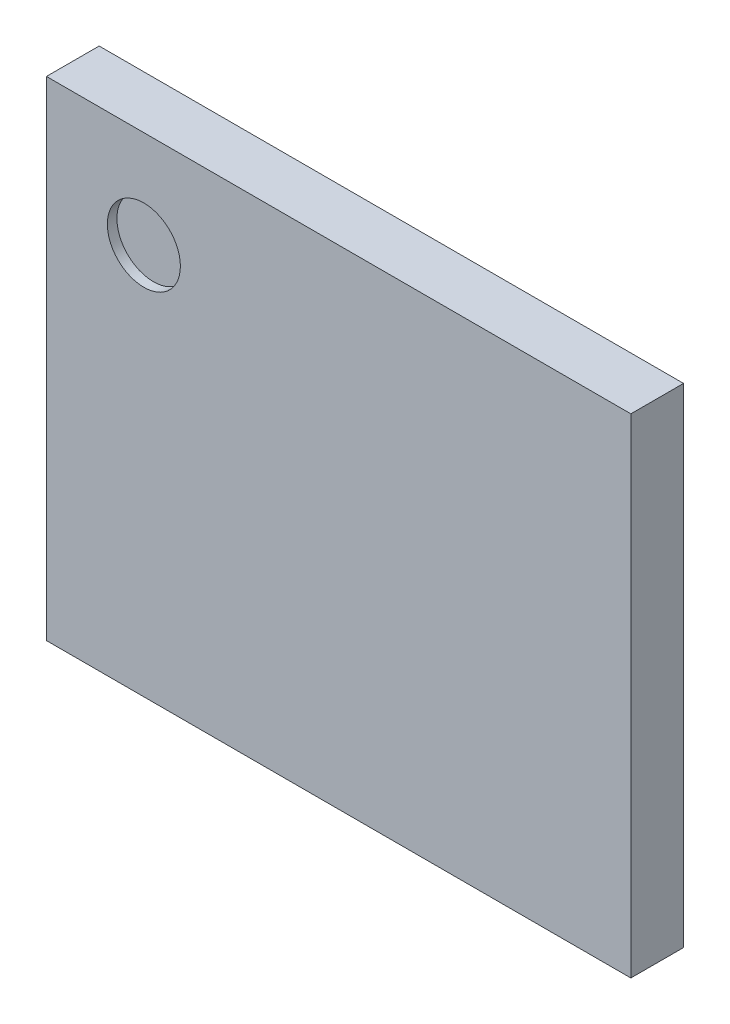
ISO-10303-21;
HEADER;
FILE_DESCRIPTION(('STEP AP214'),'2;1');
FILE_NAME('part.step','',(''),(''),'','','');
FILE_SCHEMA(('AUTOMOTIVE_DESIGN { 1 0 10303 214 1 1 1 1 }'));
ENDSEC;
DATA;
#1=APPLICATION_CONTEXT('core data for automotive mechanical design processes');
#2=APPLICATION_PROTOCOL_DEFINITION('international standard','automotive_design',2000,#1);
#3=PRODUCT_CONTEXT('',#1,'mechanical');
#4=PRODUCT('Part','Part','',(#3));
#5=PRODUCT_RELATED_PRODUCT_CATEGORY('part','',(#4));
#6=PRODUCT_DEFINITION_FORMATION('','',#4);
#7=PRODUCT_DEFINITION_CONTEXT('part definition',#1,'design');
#8=PRODUCT_DEFINITION('design','',#6,#7);
#9=PRODUCT_DEFINITION_SHAPE('','',#8);
#10=(LENGTH_UNIT() NAMED_UNIT(*) SI_UNIT(.MILLI.,.METRE.));
#11=(NAMED_UNIT(*) PLANE_ANGLE_UNIT() SI_UNIT($,.RADIAN.));
#12=(NAMED_UNIT(*) SI_UNIT($,.STERADIAN.) SOLID_ANGLE_UNIT());
#13=UNCERTAINTY_MEASURE_WITH_UNIT(LENGTH_MEASURE(1.E-05),#10,'distance_accuracy_value','');
#14=(GEOMETRIC_REPRESENTATION_CONTEXT(3) GLOBAL_UNCERTAINTY_ASSIGNED_CONTEXT((#13)) GLOBAL_UNIT_ASSIGNED_CONTEXT((#10,
#11,#12)) REPRESENTATION_CONTEXT('',''));
#15=CARTESIAN_POINT('',(0.,0.,0.));
#16=DIRECTION('',(0.,0.,1.));
#17=DIRECTION('',(1.,0.,0.));
#18=AXIS2_PLACEMENT_3D('',#15,#16,#17);
#19=CARTESIAN_POINT('',(1.016666666667,4.083333333333,0.5));
#20=DIRECTION('',(0.,0.,1.));
#21=DIRECTION('',(1.,0.,0.));
#22=AXIS2_PLACEMENT_3D('',#19,#20,#21);
#23=PLANE('',#22);
#24=CARTESIAN_POINT('',(1.016666666667,4.083333333333,0.5));
#25=DIRECTION('',(0.,0.,1.));
#26=DIRECTION('',(1.,0.,0.));
#27=AXIS2_PLACEMENT_3D('',#24,#25,#26);
#28=CIRCLE('',#27,0.38125);
#29=CARTESIAN_POINT('',(1.397916666667,4.083333333333,0.5));
#30=VERTEX_POINT('',#29);
#31=EDGE_CURVE('E26',#30,#30,#28,.T.);
#32=ORIENTED_EDGE('',*,*,#31,.T.);
#33=EDGE_LOOP('',(#32));
#34=FACE_BOUND('',#33,.T.);
#35=ADVANCED_FACE('F17',(#34),#23,.T.);
#36=CARTESIAN_POINT('',(1.016666666667,4.083333333333,0.5));
#37=DIRECTION('',(0.,0.,1.));
#38=DIRECTION('',(1.,0.,0.));
#39=AXIS2_PLACEMENT_3D('',#36,#37,#38);
#40=CYLINDRICAL_SURFACE('',#39,0.38125);
#41=ORIENTED_EDGE('',*,*,#31,.F.);
#42=DIRECTION('',(0.,0.,1.));
#43=VECTOR('',#42,1.);
#44=CARTESIAN_POINT('',(1.397916666667,4.083333333333,0.5));
#45=LINE('',#44,#43);
#46=CARTESIAN_POINT('',(1.397916666667,4.083333333333,0.6));
#47=VERTEX_POINT('',#46);
#48=EDGE_CURVE('E11',#30,#47,#45,.T.);
#49=ORIENTED_EDGE('',*,*,#48,.T.);
#50=CARTESIAN_POINT('',(1.016666666667,4.083333333333,0.6));
#51=DIRECTION('',(0.,0.,1.));
#52=DIRECTION('',(1.,0.,0.));
#53=AXIS2_PLACEMENT_3D('',#50,#51,#52);
#54=CIRCLE('',#53,0.38125);
#55=EDGE_CURVE('E72',#47,#47,#54,.T.);
#56=ORIENTED_EDGE('',*,*,#55,.T.);
#57=ORIENTED_EDGE('',*,*,#48,.F.);
#58=EDGE_LOOP('',(#41,#49,#56,#57));
#59=FACE_BOUND('',#58,.T.);
#60=ADVANCED_FACE('F70',(#59),#40,.F.);
#61=CARTESIAN_POINT('',(6.1,0.,0.05));
#62=DIRECTION('',(1.,0.,0.));
#63=DIRECTION('',(0.,1.,0.));
#64=AXIS2_PLACEMENT_3D('',#61,#62,#63);
#65=PLANE('',#64);
#66=DIRECTION('',(0.,0.,1.));
#67=VECTOR('',#66,1.);
#68=CARTESIAN_POINT('',(6.1,0.,0.05));
#69=LINE('',#68,#67);
#70=CARTESIAN_POINT('',(6.1,0.,0.05));
#71=VERTEX_POINT('',#70);
#72=CARTESIAN_POINT('',(6.1,0.,0.6));
#73=VERTEX_POINT('',#72);
#74=EDGE_CURVE('E92',#71,#73,#69,.T.);
#75=ORIENTED_EDGE('',*,*,#74,.F.);
#76=DIRECTION('',(0.,1.,0.));
#77=VECTOR('',#76,1.);
#78=CARTESIAN_POINT('',(6.1,0.,0.05));
#79=LINE('',#78,#77);
#80=CARTESIAN_POINT('',(6.1,5.1,0.05));
#81=VERTEX_POINT('',#80);
#82=EDGE_CURVE('E75',#71,#81,#79,.T.);
#83=ORIENTED_EDGE('',*,*,#82,.T.);
#84=DIRECTION('',(0.,0.,1.));
#85=VECTOR('',#84,1.);
#86=CARTESIAN_POINT('',(6.1,5.1,0.05));
#87=LINE('',#86,#85);
#88=CARTESIAN_POINT('',(6.1,5.1,0.6));
#89=VERTEX_POINT('',#88);
#90=EDGE_CURVE('E80',#81,#89,#87,.T.);
#91=ORIENTED_EDGE('',*,*,#90,.T.);
#92=DIRECTION('',(0.,1.,0.));
#93=VECTOR('',#92,1.);
#94=CARTESIAN_POINT('',(6.1,0.,0.6));
#95=LINE('',#94,#93);
#96=EDGE_CURVE('E87',#73,#89,#95,.T.);
#97=ORIENTED_EDGE('',*,*,#96,.F.);
#98=EDGE_LOOP('',(#75,#83,#91,#97));
#99=FACE_BOUND('',#98,.T.);
#100=ADVANCED_FACE('F136',(#99),#65,.T.);
#101=CARTESIAN_POINT('',(0.,0.,0.05));
#102=DIRECTION('',(0.,0.,1.));
#103=DIRECTION('',(1.,0.,0.));
#104=AXIS2_PLACEMENT_3D('',#101,#102,#103);
#105=PLANE('',#104);
#106=DIRECTION('',(1.,0.,0.));
#107=VECTOR('',#106,1.);
#108=CARTESIAN_POINT('',(0.,5.1,0.05));
#109=LINE('',#108,#107);
#110=CARTESIAN_POINT('',(0.,5.1,0.05));
#111=VERTEX_POINT('',#110);
#112=EDGE_CURVE('E107',#111,#81,#109,.T.);
#113=ORIENTED_EDGE('',*,*,#112,.T.);
#114=ORIENTED_EDGE('',*,*,#82,.F.);
#115=DIRECTION('',(1.,0.,0.));
#116=VECTOR('',#115,1.);
#117=CARTESIAN_POINT('',(0.,0.,0.05));
#118=LINE('',#117,#116);
#119=CARTESIAN_POINT('',(0.,0.,0.05));
#120=VERTEX_POINT('',#119);
#121=EDGE_CURVE('E91',#120,#71,#118,.T.);
#122=ORIENTED_EDGE('',*,*,#121,.F.);
#123=DIRECTION('',(0.,1.,0.));
#124=VECTOR('',#123,1.);
#125=CARTESIAN_POINT('',(0.,0.,0.05));
#126=LINE('',#125,#124);
#127=EDGE_CURVE('E104',#120,#111,#126,.T.);
#128=ORIENTED_EDGE('',*,*,#127,.T.);
#129=EDGE_LOOP('',(#113,#114,#122,#128));
#130=FACE_BOUND('',#129,.T.);
#131=ADVANCED_FACE('F145',(#130),#105,.F.);
#132=CARTESIAN_POINT('',(0.,5.1,0.05));
#133=DIRECTION('',(0.,1.,0.));
#134=DIRECTION('',(1.,0.,0.));
#135=AXIS2_PLACEMENT_3D('',#132,#133,#134);
#136=PLANE('',#135);
#137=ORIENTED_EDGE('',*,*,#112,.F.);
#138=DIRECTION('',(0.,0.,1.));
#139=VECTOR('',#138,1.);
#140=CARTESIAN_POINT('',(0.,5.1,0.05));
#141=LINE('',#140,#139);
#142=CARTESIAN_POINT('',(0.,5.1,0.6));
#143=VERTEX_POINT('',#142);
#144=EDGE_CURVE('E116',#111,#143,#141,.T.);
#145=ORIENTED_EDGE('',*,*,#144,.T.);
#146=DIRECTION('',(1.,0.,0.));
#147=VECTOR('',#146,1.);
#148=CARTESIAN_POINT('',(0.,5.1,0.6));
#149=LINE('',#148,#147);
#150=EDGE_CURVE('E83',#143,#89,#149,.T.);
#151=ORIENTED_EDGE('',*,*,#150,.T.);
#152=ORIENTED_EDGE('',*,*,#90,.F.);
#153=EDGE_LOOP('',(#137,#145,#151,#152));
#154=FACE_BOUND('',#153,.T.);
#155=ADVANCED_FACE('F139',(#154),#136,.T.);
#156=CARTESIAN_POINT('',(0.,0.,0.6));
#157=DIRECTION('',(0.,0.,1.));
#158=DIRECTION('',(1.,0.,0.));
#159=AXIS2_PLACEMENT_3D('',#156,#157,#158);
#160=PLANE('',#159);
#161=ORIENTED_EDGE('',*,*,#55,.F.);
#162=EDGE_LOOP('',(#161));
#163=FACE_BOUND('',#162,.T.);
#164=DIRECTION('',(0.,1.,0.));
#165=VECTOR('',#164,1.);
#166=CARTESIAN_POINT('',(0.,0.,0.6));
#167=LINE('',#166,#165);
#168=CARTESIAN_POINT('',(0.,0.,0.6));
#169=VERTEX_POINT('',#168);
#170=EDGE_CURVE('E120',#169,#143,#167,.T.);
#171=ORIENTED_EDGE('',*,*,#170,.F.);
#172=DIRECTION('',(1.,0.,0.));
#173=VECTOR('',#172,1.);
#174=CARTESIAN_POINT('',(0.,0.,0.6));
#175=LINE('',#174,#173);
#176=EDGE_CURVE('E96',#169,#73,#175,.T.);
#177=ORIENTED_EDGE('',*,*,#176,.T.);
#178=ORIENTED_EDGE('',*,*,#96,.T.);
#179=ORIENTED_EDGE('',*,*,#150,.F.);
#180=EDGE_LOOP('',(#171,#177,#178,#179));
#181=FACE_BOUND('',#180,.T.);
#182=ADVANCED_FACE('F130',(#163,#181),#160,.T.);
#183=CARTESIAN_POINT('',(0.,0.,0.05));
#184=DIRECTION('',(0.,1.,0.));
#185=DIRECTION('',(1.,0.,0.));
#186=AXIS2_PLACEMENT_3D('',#183,#184,#185);
#187=PLANE('',#186);
#188=ORIENTED_EDGE('',*,*,#74,.T.);
#189=ORIENTED_EDGE('',*,*,#176,.F.);
#190=DIRECTION('',(0.,0.,1.));
#191=VECTOR('',#190,1.);
#192=CARTESIAN_POINT('',(0.,0.,0.05));
#193=LINE('',#192,#191);
#194=EDGE_CURVE('E97',#120,#169,#193,.T.);
#195=ORIENTED_EDGE('',*,*,#194,.F.);
#196=ORIENTED_EDGE('',*,*,#121,.T.);
#197=EDGE_LOOP('',(#188,#189,#195,#196));
#198=FACE_BOUND('',#197,.T.);
#199=ADVANCED_FACE('F134',(#198),#187,.F.);
#200=CARTESIAN_POINT('',(0.,0.,0.05));
#201=DIRECTION('',(1.,0.,0.));
#202=DIRECTION('',(0.,1.,0.));
#203=AXIS2_PLACEMENT_3D('',#200,#201,#202);
#204=PLANE('',#203);
#205=ORIENTED_EDGE('',*,*,#170,.T.);
#206=ORIENTED_EDGE('',*,*,#144,.F.);
#207=ORIENTED_EDGE('',*,*,#127,.F.);
#208=ORIENTED_EDGE('',*,*,#194,.T.);
#209=EDGE_LOOP('',(#205,#206,#207,#208));
#210=FACE_BOUND('',#209,.T.);
#211=ADVANCED_FACE('F143',(#210),#204,.F.);
#212=CLOSED_SHELL('',(#35,#60,#100,#131,#155,#182,#199,#211));
#213=MANIFOLD_SOLID_BREP('B1',#212);
#214=ADVANCED_BREP_SHAPE_REPRESENTATION('',(#18,#213),#14);
#215=SHAPE_DEFINITION_REPRESENTATION(#9,#214);
ENDSEC;
END-ISO-10303-21;
